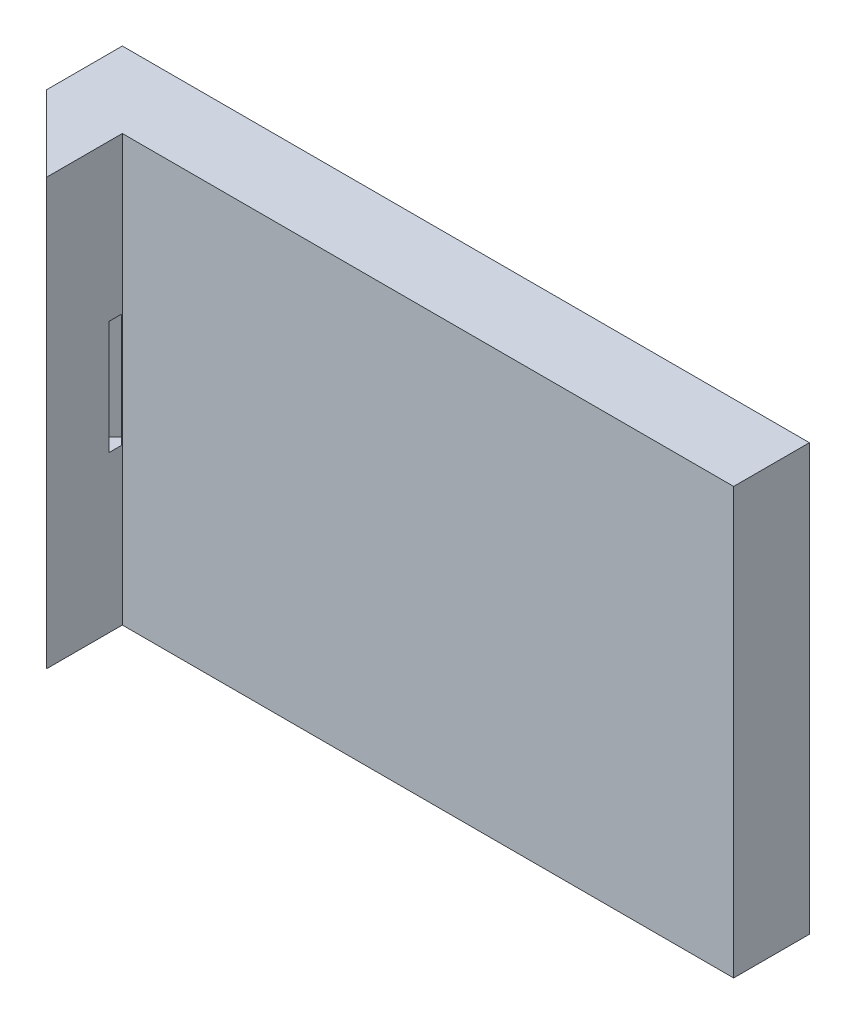
ISO-10303-21;
HEADER;
FILE_DESCRIPTION(('STEP AP214'),'2;1');
FILE_NAME('part.step','',(''),(''),'','','');
FILE_SCHEMA(('AUTOMOTIVE_DESIGN { 1 0 10303 214 1 1 1 1 }'));
ENDSEC;
DATA;
#1=APPLICATION_CONTEXT('core data for automotive mechanical design processes');
#2=APPLICATION_PROTOCOL_DEFINITION('international standard','automotive_design',2000,#1);
#3=PRODUCT_CONTEXT('',#1,'mechanical');
#4=PRODUCT('Part','Part','',(#3));
#5=PRODUCT_RELATED_PRODUCT_CATEGORY('part','',(#4));
#6=PRODUCT_DEFINITION_FORMATION('','',#4);
#7=PRODUCT_DEFINITION_CONTEXT('part definition',#1,'design');
#8=PRODUCT_DEFINITION('design','',#6,#7);
#9=PRODUCT_DEFINITION_SHAPE('','',#8);
#10=(LENGTH_UNIT() NAMED_UNIT(*) SI_UNIT(.MILLI.,.METRE.));
#11=(NAMED_UNIT(*) PLANE_ANGLE_UNIT() SI_UNIT($,.RADIAN.));
#12=(NAMED_UNIT(*) SI_UNIT($,.STERADIAN.) SOLID_ANGLE_UNIT());
#13=UNCERTAINTY_MEASURE_WITH_UNIT(LENGTH_MEASURE(1.E-05),#10,'distance_accuracy_value','');
#14=(GEOMETRIC_REPRESENTATION_CONTEXT(3) GLOBAL_UNCERTAINTY_ASSIGNED_CONTEXT((#13)) GLOBAL_UNIT_ASSIGNED_CONTEXT((#10,
#11,#12)) REPRESENTATION_CONTEXT('',''));
#15=CARTESIAN_POINT('',(0.,0.,0.));
#16=DIRECTION('',(0.,0.,1.));
#17=DIRECTION('',(1.,0.,0.));
#18=AXIS2_PLACEMENT_3D('',#15,#16,#17);
#19=CARTESIAN_POINT('',(0.,0.,10.));
#20=DIRECTION('',(0.,0.,-1.));
#21=DIRECTION('',(-1.,0.,0.));
#22=AXIS2_PLACEMENT_3D('',#19,#20,#21);
#23=PLANE('',#22);
#24=DIRECTION('',(1.,0.,0.));
#25=VECTOR('',#24,1.);
#26=CARTESIAN_POINT('',(-175.,-28.1,10.));
#27=LINE('',#26,#25);
#28=CARTESIAN_POINT('',(-175.,-28.1,10.));
#29=VERTEX_POINT('',#28);
#30=CARTESIAN_POINT('',(-94.3,-28.1,10.));
#31=VERTEX_POINT('',#30);
#32=EDGE_CURVE('E151',#29,#31,#27,.T.);
#33=ORIENTED_EDGE('',*,*,#32,.T.);
#34=DIRECTION('',(0.,-1.,0.));
#35=VECTOR('',#34,1.);
#36=CARTESIAN_POINT('',(-94.3,28.1,10.));
#37=LINE('',#36,#35);
#38=CARTESIAN_POINT('',(-94.3,28.1,10.));
#39=VERTEX_POINT('',#38);
#40=EDGE_CURVE('E49',#39,#31,#37,.T.);
#41=ORIENTED_EDGE('',*,*,#40,.F.);
#42=DIRECTION('',(-1.,0.,0.));
#43=VECTOR('',#42,1.);
#44=CARTESIAN_POINT('',(-175.,28.1,10.));
#45=LINE('',#44,#43);
#46=CARTESIAN_POINT('',(-175.,28.1,10.));
#47=VERTEX_POINT('',#46);
#48=EDGE_CURVE('E150',#39,#47,#45,.T.);
#49=ORIENTED_EDGE('',*,*,#48,.T.);
#50=DIRECTION('',(0.,1.,0.));
#51=VECTOR('',#50,1.);
#52=CARTESIAN_POINT('',(-175.,-28.1,10.));
#53=LINE('',#52,#51);
#54=EDGE_CURVE('E170',#29,#47,#53,.T.);
#55=ORIENTED_EDGE('',*,*,#54,.F.);
#56=EDGE_LOOP('',(#33,#41,#49,#55));
#57=FACE_BOUND('',#56,.T.);
#58=ADVANCED_FACE('F38',(#57),#23,.F.);
#59=CARTESIAN_POINT('',(-175.,28.1,10.));
#60=DIRECTION('',(0.,-1.,0.));
#61=DIRECTION('',(0.,0.,-1.));
#62=AXIS2_PLACEMENT_3D('',#59,#60,#61);
#63=PLANE('',#62);
#64=ORIENTED_EDGE('',*,*,#48,.F.);
#65=DIRECTION('',(0.,0.,1.));
#66=VECTOR('',#65,1.);
#67=CARTESIAN_POINT('',(-94.3,28.1,0.));
#68=LINE('',#67,#66);
#69=CARTESIAN_POINT('',(-94.3,28.1,0.));
#70=VERTEX_POINT('',#69);
#71=EDGE_CURVE('E11',#70,#39,#68,.T.);
#72=ORIENTED_EDGE('',*,*,#71,.F.);
#73=DIRECTION('',(-1.,0.,0.));
#74=VECTOR('',#73,1.);
#75=CARTESIAN_POINT('',(-175.,28.1,0.));
#76=LINE('',#75,#74);
#77=CARTESIAN_POINT('',(-185.,28.1,0.));
#78=VERTEX_POINT('',#77);
#79=EDGE_CURVE('E132',#70,#78,#76,.T.);
#80=ORIENTED_EDGE('',*,*,#79,.T.);
#81=DIRECTION('',(0.,0.,-1.));
#82=VECTOR('',#81,1.);
#83=CARTESIAN_POINT('',(-185.,28.1,0.));
#84=LINE('',#83,#82);
#85=CARTESIAN_POINT('',(-185.,28.1,10.));
#86=VERTEX_POINT('',#85);
#87=EDGE_CURVE('E156',#86,#78,#84,.T.);
#88=ORIENTED_EDGE('',*,*,#87,.F.);
#89=DIRECTION('',(-0.707106781186548,0.,-0.707106781186547));
#90=VECTOR('',#89,1.);
#91=CARTESIAN_POINT('',(-175.,28.1,20.));
#92=LINE('',#91,#90);
#93=CARTESIAN_POINT('',(-175.,28.1,20.));
#94=VERTEX_POINT('',#93);
#95=EDGE_CURVE('E169',#94,#86,#92,.T.);
#96=ORIENTED_EDGE('',*,*,#95,.F.);
#97=DIRECTION('',(0.,0.,-1.));
#98=VECTOR('',#97,1.);
#99=CARTESIAN_POINT('',(-175.,28.1,20.));
#100=LINE('',#99,#98);
#101=EDGE_CURVE('E140',#94,#47,#100,.T.);
#102=ORIENTED_EDGE('',*,*,#101,.T.);
#103=EDGE_LOOP('',(#64,#72,#80,#88,#96,#102));
#104=FACE_BOUND('',#103,.T.);
#105=ADVANCED_FACE('F40',(#104),#63,.F.);
#106=CARTESIAN_POINT('',(-175.,-28.1,10.));
#107=DIRECTION('',(0.,1.,0.));
#108=DIRECTION('',(0.,0.,1.));
#109=AXIS2_PLACEMENT_3D('',#106,#107,#108);
#110=PLANE('',#109);
#111=DIRECTION('',(1.,0.,0.));
#112=VECTOR('',#111,1.);
#113=CARTESIAN_POINT('',(-175.,-28.1,0.));
#114=LINE('',#113,#112);
#115=CARTESIAN_POINT('',(-185.,-28.1,0.));
#116=VERTEX_POINT('',#115);
#117=CARTESIAN_POINT('',(-94.3,-28.1,0.));
#118=VERTEX_POINT('',#117);
#119=EDGE_CURVE('E125',#116,#118,#114,.T.);
#120=ORIENTED_EDGE('',*,*,#119,.T.);
#121=DIRECTION('',(0.,0.,1.));
#122=VECTOR('',#121,1.);
#123=CARTESIAN_POINT('',(-94.3,-28.1,0.));
#124=LINE('',#123,#122);
#125=EDGE_CURVE('E116',#118,#31,#124,.T.);
#126=ORIENTED_EDGE('',*,*,#125,.T.);
#127=ORIENTED_EDGE('',*,*,#32,.F.);
#128=DIRECTION('',(0.,0.,-1.));
#129=VECTOR('',#128,1.);
#130=CARTESIAN_POINT('',(-175.,-28.1,20.));
#131=LINE('',#130,#129);
#132=CARTESIAN_POINT('',(-175.,-28.1,20.));
#133=VERTEX_POINT('',#132);
#134=EDGE_CURVE('E167',#133,#29,#131,.T.);
#135=ORIENTED_EDGE('',*,*,#134,.F.);
#136=DIRECTION('',(-0.707106781186548,0.,-0.707106781186547));
#137=VECTOR('',#136,1.);
#138=CARTESIAN_POINT('',(-175.,-28.1,20.));
#139=LINE('',#138,#137);
#140=CARTESIAN_POINT('',(-185.,-28.1,10.));
#141=VERTEX_POINT('',#140);
#142=EDGE_CURVE('E124',#133,#141,#139,.T.);
#143=ORIENTED_EDGE('',*,*,#142,.T.);
#144=DIRECTION('',(0.,0.,1.));
#145=VECTOR('',#144,1.);
#146=CARTESIAN_POINT('',(-185.,-28.1,0.));
#147=LINE('',#146,#145);
#148=EDGE_CURVE('E134',#116,#141,#147,.T.);
#149=ORIENTED_EDGE('',*,*,#148,.F.);
#150=EDGE_LOOP('',(#120,#126,#127,#135,#143,#149));
#151=FACE_BOUND('',#150,.T.);
#152=ADVANCED_FACE('F135',(#151),#110,.F.);
#153=CARTESIAN_POINT('',(0.,0.,0.));
#154=DIRECTION('',(0.,0.,-1.));
#155=DIRECTION('',(-1.,0.,0.));
#156=AXIS2_PLACEMENT_3D('',#153,#154,#155);
#157=PLANE('',#156);
#158=DIRECTION('',(0.,-1.,0.));
#159=VECTOR('',#158,1.);
#160=CARTESIAN_POINT('',(-94.3,28.1,0.));
#161=LINE('',#160,#159);
#162=EDGE_CURVE('E42',#70,#118,#161,.T.);
#163=ORIENTED_EDGE('',*,*,#162,.T.);
#164=ORIENTED_EDGE('',*,*,#119,.F.);
#165=DIRECTION('',(0.,-1.,0.));
#166=VECTOR('',#165,1.);
#167=CARTESIAN_POINT('',(-185.,-28.1,0.));
#168=LINE('',#167,#166);
#169=EDGE_CURVE('E160',#78,#116,#168,.T.);
#170=ORIENTED_EDGE('',*,*,#169,.F.);
#171=ORIENTED_EDGE('',*,*,#79,.F.);
#172=EDGE_LOOP('',(#163,#164,#170,#171));
#173=FACE_BOUND('',#172,.T.);
#174=ADVANCED_FACE('F129',(#173),#157,.T.);
#175=CARTESIAN_POINT('',(-185.,0.,0.));
#176=DIRECTION('',(1.,0.,0.));
#177=DIRECTION('',(0.,0.,-1.));
#178=AXIS2_PLACEMENT_3D('',#175,#176,#177);
#179=PLANE('',#178);
#180=ORIENTED_EDGE('',*,*,#148,.T.);
#181=DIRECTION('',(0.,1.,0.));
#182=VECTOR('',#181,1.);
#183=CARTESIAN_POINT('',(-185.,-28.1,10.));
#184=LINE('',#183,#182);
#185=EDGE_CURVE('E161',#141,#86,#184,.T.);
#186=ORIENTED_EDGE('',*,*,#185,.T.);
#187=ORIENTED_EDGE('',*,*,#87,.T.);
#188=ORIENTED_EDGE('',*,*,#169,.T.);
#189=EDGE_LOOP('',(#180,#186,#187,#188));
#190=FACE_BOUND('',#189,.T.);
#191=ADVANCED_FACE('F281',(#190),#179,.F.);
#192=CARTESIAN_POINT('',(-175.,-28.1,20.));
#193=DIRECTION('',(-1.,0.,0.));
#194=DIRECTION('',(0.,0.,1.));
#195=AXIS2_PLACEMENT_3D('',#192,#193,#194);
#196=PLANE('',#195);
#197=DIRECTION('',(0.,0.,1.));
#198=VECTOR('',#197,1.);
#199=CARTESIAN_POINT('',(-175.,-7.5,20.));
#200=LINE('',#199,#198);
#201=CARTESIAN_POINT('',(-175.,-7.5,10.1005050633884));
#202=VERTEX_POINT('',#201);
#203=CARTESIAN_POINT('',(-175.,-7.5,11.7677669529664));
#204=VERTEX_POINT('',#203);
#205=EDGE_CURVE('E166',#202,#204,#200,.T.);
#206=ORIENTED_EDGE('',*,*,#205,.T.);
#207=DIRECTION('',(0.,1.,0.));
#208=VECTOR('',#207,1.);
#209=CARTESIAN_POINT('',(-175.,-28.1,11.7677669529664));
#210=LINE('',#209,#208);
#211=CARTESIAN_POINT('',(-175.,7.5,11.7677669529664));
#212=VERTEX_POINT('',#211);
#213=EDGE_CURVE('E186',#204,#212,#210,.T.);
#214=ORIENTED_EDGE('',*,*,#213,.T.);
#215=DIRECTION('',(0.,0.,-1.));
#216=VECTOR('',#215,1.);
#217=CARTESIAN_POINT('',(-175.,7.5,20.));
#218=LINE('',#217,#216);
#219=CARTESIAN_POINT('',(-175.,7.5,10.1005050633884));
#220=VERTEX_POINT('',#219);
#221=EDGE_CURVE('E175',#212,#220,#218,.T.);
#222=ORIENTED_EDGE('',*,*,#221,.T.);
#223=DIRECTION('',(0.,1.,0.));
#224=VECTOR('',#223,1.);
#225=CARTESIAN_POINT('',(-175.,-28.1,10.1005050633884));
#226=LINE('',#225,#224);
#227=EDGE_CURVE('E147',#202,#220,#226,.T.);
#228=ORIENTED_EDGE('',*,*,#227,.F.);
#229=EDGE_LOOP('',(#206,#214,#222,#228));
#230=FACE_BOUND('',#229,.T.);
#231=ORIENTED_EDGE('',*,*,#54,.T.);
#232=ORIENTED_EDGE('',*,*,#101,.F.);
#233=DIRECTION('',(0.,1.,0.));
#234=VECTOR('',#233,1.);
#235=CARTESIAN_POINT('',(-175.,-28.1,20.));
#236=LINE('',#235,#234);
#237=EDGE_CURVE('E176',#133,#94,#236,.T.);
#238=ORIENTED_EDGE('',*,*,#237,.F.);
#239=ORIENTED_EDGE('',*,*,#134,.T.);
#240=EDGE_LOOP('',(#231,#232,#238,#239));
#241=FACE_BOUND('',#240,.T.);
#242=ADVANCED_FACE('F247',(#230,#241),#196,.F.);
#243=CARTESIAN_POINT('',(-175.,-28.1,20.));
#244=DIRECTION('',(0.707106781186547,0.,-0.707106781186548));
#245=DIRECTION('',(-0.707106781186548,0.,-0.707106781186547));
#246=AXIS2_PLACEMENT_3D('',#243,#244,#245);
#247=PLANE('',#246);
#248=DIRECTION('',(-0.70710678118655,0.,-0.707106781186545));
#249=VECTOR('',#248,1.);
#250=CARTESIAN_POINT('',(-180.883883476483,7.5,14.1161165235168));
#251=LINE('',#250,#249);
#252=CARTESIAN_POINT('',(-179.116116523517,7.5,15.8838834764832));
#253=VERTEX_POINT('',#252);
#254=CARTESIAN_POINT('',(-180.883883476483,7.5,14.1161165235168));
#255=VERTEX_POINT('',#254);
#256=EDGE_CURVE('E200',#253,#255,#251,.T.);
#257=ORIENTED_EDGE('',*,*,#256,.F.);
#258=DIRECTION('',(0.,1.,0.));
#259=VECTOR('',#258,1.);
#260=CARTESIAN_POINT('',(-179.116116523517,7.5,15.8838834764832));
#261=LINE('',#260,#259);
#262=CARTESIAN_POINT('',(-179.116116523517,-7.5,15.8838834764832));
#263=VERTEX_POINT('',#262);
#264=EDGE_CURVE('E209',#263,#253,#261,.T.);
#265=ORIENTED_EDGE('',*,*,#264,.F.);
#266=DIRECTION('',(0.70710678118655,0.,0.707106781186545));
#267=VECTOR('',#266,1.);
#268=CARTESIAN_POINT('',(-180.883883476483,-7.5,14.1161165235168));
#269=LINE('',#268,#267);
#270=CARTESIAN_POINT('',(-180.883883476483,-7.5,14.1161165235168));
#271=VERTEX_POINT('',#270);
#272=EDGE_CURVE('E201',#271,#263,#269,.T.);
#273=ORIENTED_EDGE('',*,*,#272,.F.);
#274=DIRECTION('',(0.,-1.,0.));
#275=VECTOR('',#274,1.);
#276=CARTESIAN_POINT('',(-180.883883476483,7.5,14.1161165235168));
#277=LINE('',#276,#275);
#278=EDGE_CURVE('E205',#255,#271,#277,.T.);
#279=ORIENTED_EDGE('',*,*,#278,.F.);
#280=EDGE_LOOP('',(#257,#265,#273,#279));
#281=FACE_BOUND('',#280,.T.);
#282=ORIENTED_EDGE('',*,*,#95,.T.);
#283=ORIENTED_EDGE('',*,*,#185,.F.);
#284=ORIENTED_EDGE('',*,*,#142,.F.);
#285=ORIENTED_EDGE('',*,*,#237,.T.);
#286=EDGE_LOOP('',(#282,#283,#284,#285));
#287=FACE_BOUND('',#286,.T.);
#288=ADVANCED_FACE('F259',(#281,#287),#247,.F.);
#289=CARTESIAN_POINT('',(-92.5502525316935,0.,92.5502525316942));
#290=DIRECTION('',(-0.707106781186545,0.,0.70710678118655));
#291=DIRECTION('',(0.70710678118655,0.,0.707106781186545));
#292=AXIS2_PLACEMENT_3D('',#289,#290,#291);
#293=PLANE('',#292);
#294=ORIENTED_EDGE('',*,*,#227,.T.);
#295=DIRECTION('',(-0.70710678118655,0.,-0.707106781186545));
#296=VECTOR('',#295,1.);
#297=CARTESIAN_POINT('',(-175.934136008177,7.5,9.16636905521099));
#298=LINE('',#297,#296);
#299=CARTESIAN_POINT('',(-175.934136008177,7.5,9.16636905521099));
#300=VERTEX_POINT('',#299);
#301=EDGE_CURVE('E231',#220,#300,#298,.T.);
#302=ORIENTED_EDGE('',*,*,#301,.T.);
#303=DIRECTION('',(0.,-1.,0.));
#304=VECTOR('',#303,1.);
#305=CARTESIAN_POINT('',(-175.934136008177,7.5,9.16636905521099));
#306=LINE('',#305,#304);
#307=CARTESIAN_POINT('',(-175.934136008177,-7.5,9.16636905521099));
#308=VERTEX_POINT('',#307);
#309=EDGE_CURVE('E227',#300,#308,#306,.T.);
#310=ORIENTED_EDGE('',*,*,#309,.T.);
#311=DIRECTION('',(0.70710678118655,0.,0.707106781186545));
#312=VECTOR('',#311,1.);
#313=CARTESIAN_POINT('',(-175.934136008177,-7.5,9.16636905521099));
#314=LINE('',#313,#312);
#315=EDGE_CURVE('E213',#308,#202,#314,.T.);
#316=ORIENTED_EDGE('',*,*,#315,.T.);
#317=EDGE_LOOP('',(#294,#302,#310,#316));
#318=FACE_BOUND('',#317,.T.);
#319=ADVANCED_FACE('F238',(#318),#293,.T.);
#320=CARTESIAN_POINT('',(-174.166369055211,7.5,10.9341360081774));
#321=DIRECTION('',(0.707106781186548,0.,0.707106781186547));
#322=DIRECTION('',(0.707106781186547,0.,-0.707106781186548));
#323=AXIS2_PLACEMENT_3D('',#320,#321,#322);
#324=PLANE('',#323);
#325=DIRECTION('',(-0.707106781186547,0.,0.707106781186548));
#326=VECTOR('',#325,1.);
#327=CARTESIAN_POINT('',(-174.166369055211,-7.5,10.9341360081774));
#328=LINE('',#327,#326);
#329=EDGE_CURVE('E210',#204,#263,#328,.T.);
#330=ORIENTED_EDGE('',*,*,#329,.T.);
#331=ORIENTED_EDGE('',*,*,#264,.T.);
#332=DIRECTION('',(-0.707106781186547,0.,0.707106781186548));
#333=VECTOR('',#332,1.);
#334=CARTESIAN_POINT('',(-174.166369055211,7.5,10.9341360081774));
#335=LINE('',#334,#333);
#336=EDGE_CURVE('E196',#212,#253,#335,.T.);
#337=ORIENTED_EDGE('',*,*,#336,.F.);
#338=ORIENTED_EDGE('',*,*,#213,.F.);
#339=EDGE_LOOP('',(#330,#331,#337,#338));
#340=FACE_BOUND('',#339,.T.);
#341=ADVANCED_FACE('F251',(#340),#324,.F.);
#342=CARTESIAN_POINT('',(-175.934136008177,-7.5,9.16636905521099));
#343=DIRECTION('',(0.,-1.,0.));
#344=DIRECTION('',(0.,0.,-1.));
#345=AXIS2_PLACEMENT_3D('',#342,#343,#344);
#346=PLANE('',#345);
#347=ORIENTED_EDGE('',*,*,#315,.F.);
#348=DIRECTION('',(-0.707106781186547,0.,0.707106781186548));
#349=VECTOR('',#348,1.);
#350=CARTESIAN_POINT('',(-175.934136008177,-7.5,9.16636905521099));
#351=LINE('',#350,#349);
#352=EDGE_CURVE('E206',#308,#271,#351,.T.);
#353=ORIENTED_EDGE('',*,*,#352,.T.);
#354=ORIENTED_EDGE('',*,*,#272,.T.);
#355=ORIENTED_EDGE('',*,*,#329,.F.);
#356=ORIENTED_EDGE('',*,*,#205,.F.);
#357=EDGE_LOOP('',(#347,#353,#354,#355,#356));
#358=FACE_BOUND('',#357,.T.);
#359=ADVANCED_FACE('F253',(#358),#346,.F.);
#360=CARTESIAN_POINT('',(-175.934136008177,7.5,9.16636905521099));
#361=DIRECTION('',(0.,1.,0.));
#362=DIRECTION('',(0.,0.,1.));
#363=AXIS2_PLACEMENT_3D('',#360,#361,#362);
#364=PLANE('',#363);
#365=ORIENTED_EDGE('',*,*,#336,.T.);
#366=ORIENTED_EDGE('',*,*,#256,.T.);
#367=DIRECTION('',(-0.707106781186547,0.,0.707106781186548));
#368=VECTOR('',#367,1.);
#369=CARTESIAN_POINT('',(-175.934136008177,7.5,9.16636905521099));
#370=LINE('',#369,#368);
#371=EDGE_CURVE('E202',#300,#255,#370,.T.);
#372=ORIENTED_EDGE('',*,*,#371,.F.);
#373=ORIENTED_EDGE('',*,*,#301,.F.);
#374=ORIENTED_EDGE('',*,*,#221,.F.);
#375=EDGE_LOOP('',(#365,#366,#372,#373,#374));
#376=FACE_BOUND('',#375,.T.);
#377=ADVANCED_FACE('F244',(#376),#364,.F.);
#378=CARTESIAN_POINT('',(-175.934136008177,7.5,9.16636905521099));
#379=DIRECTION('',(-0.707106781186548,0.,-0.707106781186547));
#380=DIRECTION('',(-0.707106781186547,0.,0.707106781186548));
#381=AXIS2_PLACEMENT_3D('',#378,#379,#380);
#382=PLANE('',#381);
#383=ORIENTED_EDGE('',*,*,#278,.T.);
#384=ORIENTED_EDGE('',*,*,#352,.F.);
#385=ORIENTED_EDGE('',*,*,#309,.F.);
#386=ORIENTED_EDGE('',*,*,#371,.T.);
#387=EDGE_LOOP('',(#383,#384,#385,#386));
#388=FACE_BOUND('',#387,.T.);
#389=ADVANCED_FACE('F262',(#388),#382,.F.);
#390=CARTESIAN_POINT('',(-94.3,28.1,0.));
#391=DIRECTION('',(-1.,0.,0.));
#392=DIRECTION('',(0.,0.,1.));
#393=AXIS2_PLACEMENT_3D('',#390,#391,#392);
#394=PLANE('',#393);
#395=ORIENTED_EDGE('',*,*,#40,.T.);
#396=ORIENTED_EDGE('',*,*,#125,.F.);
#397=ORIENTED_EDGE('',*,*,#162,.F.);
#398=ORIENTED_EDGE('',*,*,#71,.T.);
#399=EDGE_LOOP('',(#395,#396,#397,#398));
#400=FACE_BOUND('',#399,.T.);
#401=ADVANCED_FACE('F118',(#400),#394,.F.);
#402=CLOSED_SHELL('',(#58,#105,#152,#174,#191,#242,#288,#319,#341,#359,#377,#389,#401));
#403=MANIFOLD_SOLID_BREP('B2',#402);
#404=ADVANCED_BREP_SHAPE_REPRESENTATION('',(#18,#403),#14);
#405=SHAPE_DEFINITION_REPRESENTATION(#9,#404);
ENDSEC;
END-ISO-10303-21;
